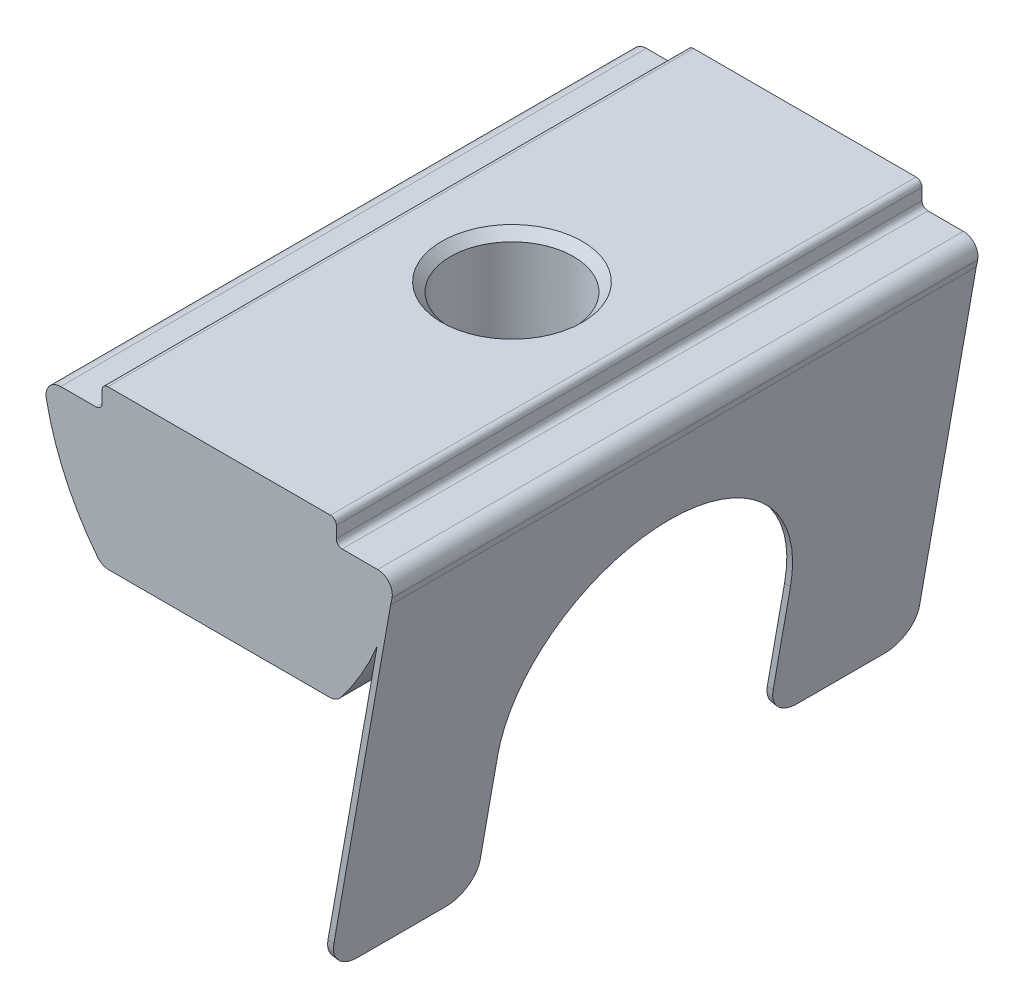
ISO-10303-21;
HEADER;
FILE_DESCRIPTION(('STEP AP214'),'2;1');
FILE_NAME('part.step','',(''),(''),'','','');
FILE_SCHEMA(('AUTOMOTIVE_DESIGN { 1 0 10303 214 1 1 1 1 }'));
ENDSEC;
DATA;
#1=APPLICATION_CONTEXT('core data for automotive mechanical design processes');
#2=APPLICATION_PROTOCOL_DEFINITION('international standard','automotive_design',2000,#1);
#3=PRODUCT_CONTEXT('',#1,'mechanical');
#4=PRODUCT('Part','Part','',(#3));
#5=PRODUCT_RELATED_PRODUCT_CATEGORY('part','',(#4));
#6=PRODUCT_DEFINITION_FORMATION('','',#4);
#7=PRODUCT_DEFINITION_CONTEXT('part definition',#1,'design');
#8=PRODUCT_DEFINITION('design','',#6,#7);
#9=PRODUCT_DEFINITION_SHAPE('','',#8);
#10=(LENGTH_UNIT() NAMED_UNIT(*) SI_UNIT(.MILLI.,.METRE.));
#11=(NAMED_UNIT(*) PLANE_ANGLE_UNIT() SI_UNIT($,.RADIAN.));
#12=(NAMED_UNIT(*) SI_UNIT($,.STERADIAN.) SOLID_ANGLE_UNIT());
#13=UNCERTAINTY_MEASURE_WITH_UNIT(LENGTH_MEASURE(1.E-05),#10,'distance_accuracy_value','');
#14=(GEOMETRIC_REPRESENTATION_CONTEXT(3) GLOBAL_UNCERTAINTY_ASSIGNED_CONTEXT((#13)) GLOBAL_UNIT_ASSIGNED_CONTEXT((#10,
#11,#12)) REPRESENTATION_CONTEXT('',''));
#15=CARTESIAN_POINT('',(0.,0.,0.));
#16=DIRECTION('',(0.,0.,1.));
#17=DIRECTION('',(1.,0.,0.));
#18=AXIS2_PLACEMENT_3D('',#15,#16,#17);
#19=CARTESIAN_POINT('',(3.74257369033,-10.9025007891587,-23.0356452170601));
#20=DIRECTION('',(-0.173648177666917,-0.984807753012211,0.));
#21=DIRECTION('',(0.984807753012211,-0.173648177666917,0.));
#22=AXIS2_PLACEMENT_3D('',#19,#20,#21);
#23=PLANE('',#22);
#24=DIRECTION('',(0.,0.,1.));
#25=VECTOR('',#24,1.);
#26=CARTESIAN_POINT('',(3.74257369033,-10.9025007891587,-23.0356452170601));
#27=LINE('',#26,#25);
#28=CARTESIAN_POINT('',(3.74257369033,-10.9025007891587,6.));
#29=VERTEX_POINT('',#28);
#30=CARTESIAN_POINT('',(3.74257369033,-10.9025007891587,9.));
#31=VERTEX_POINT('',#30);
#32=EDGE_CURVE('E248',#29,#31,#27,.T.);
#33=ORIENTED_EDGE('',*,*,#32,.T.);
#34=DIRECTION('',(0.984807753012211,-0.173648177666917,0.));
#35=VECTOR('',#34,1.);
#36=CARTESIAN_POINT('',(3.54561213972756,-10.8677711536253,9.));
#37=LINE('',#36,#35);
#38=CARTESIAN_POINT('',(3.54561213972756,-10.8677711536253,9.));
#39=VERTEX_POINT('',#38);
#40=EDGE_CURVE('E397',#31,#39,#37,.F.);
#41=ORIENTED_EDGE('',*,*,#40,.T.);
#42=DIRECTION('',(0.,0.,1.));
#43=VECTOR('',#42,1.);
#44=CARTESIAN_POINT('',(3.54561213972756,-10.8677711536253,-23.0356452170601));
#45=LINE('',#44,#43);
#46=CARTESIAN_POINT('',(3.54561213972756,-10.8677711536253,6.));
#47=VERTEX_POINT('',#46);
#48=EDGE_CURVE('E243',#47,#39,#45,.T.);
#49=ORIENTED_EDGE('',*,*,#48,.F.);
#50=DIRECTION('',(-0.984807753012211,0.173648177666917,0.));
#51=VECTOR('',#50,1.);
#52=CARTESIAN_POINT('',(3.74257369033,-10.9025007891587,6.));
#53=LINE('',#52,#51);
#54=EDGE_CURVE('E395',#47,#29,#53,.F.);
#55=ORIENTED_EDGE('',*,*,#54,.T.);
#56=EDGE_LOOP('',(#33,#41,#49,#55));
#57=FACE_BOUND('',#56,.T.);
#58=ADVANCED_FACE('F16',(#57),#23,.T.);
#59=CARTESIAN_POINT('',(-2.92669013738907,3.04638701625612,10.));
#60=DIRECTION('',(0.,0.,-1.));
#61=DIRECTION('',(-1.,0.,0.));
#62=AXIS2_PLACEMENT_3D('',#59,#60,#61);
#63=CYLINDRICAL_SURFACE('',#62,9.);
#64=CARTESIAN_POINT('',(-2.92669013738907,3.04638701625612,-10.));
#65=DIRECTION('',(0.,0.,1.));
#66=DIRECTION('',(-1.,0.,0.));
#67=AXIS2_PLACEMENT_3D('',#64,#65,#66);
#68=CIRCLE('',#67,9.);
#69=CARTESIAN_POINT('',(5.85374216436443,1.0705305957833,-10.));
#70=VERTEX_POINT('',#69);
#71=CARTESIAN_POINT('',(5.90287030593252,1.30315370492611,-10.));
#72=VERTEX_POINT('',#71);
#73=EDGE_CURVE('E295',#70,#72,#68,.T.);
#74=ORIENTED_EDGE('',*,*,#73,.T.);
#75=DIRECTION('',(0.,0.,-1.));
#76=VECTOR('',#75,1.);
#77=CARTESIAN_POINT('',(5.90287030593252,1.30315370492611,10.));
#78=LINE('',#77,#76);
#79=CARTESIAN_POINT('',(5.90287030593252,1.30315370492611,10.));
#80=VERTEX_POINT('',#79);
#81=EDGE_CURVE('E382',#72,#80,#78,.F.);
#82=ORIENTED_EDGE('',*,*,#81,.T.);
#83=CARTESIAN_POINT('',(-2.92669013738907,3.04638701625612,10.));
#84=DIRECTION('',(0.,0.,1.));
#85=DIRECTION('',(-1.,0.,0.));
#86=AXIS2_PLACEMENT_3D('',#83,#84,#85);
#87=CIRCLE('',#86,9.);
#88=CARTESIAN_POINT('',(5.85374216436443,1.0705305957833,10.));
#89=VERTEX_POINT('',#88);
#90=EDGE_CURVE('E272',#89,#80,#87,.T.);
#91=ORIENTED_EDGE('',*,*,#90,.F.);
#92=DIRECTION('',(0.,0.,-1.));
#93=VECTOR('',#92,1.);
#94=CARTESIAN_POINT('',(5.85374216436442,1.07053059578327,10.));
#95=LINE('',#94,#93);
#96=EDGE_CURVE('E255',#89,#70,#95,.T.);
#97=ORIENTED_EDGE('',*,*,#96,.T.);
#98=EDGE_LOOP('',(#74,#82,#91,#97));
#99=FACE_BOUND('',#98,.T.);
#100=ADVANCED_FACE('F433',(#99),#63,.T.);
#101=CARTESIAN_POINT('',(-4.,1.9,10.));
#102=DIRECTION('',(1.,0.,0.));
#103=DIRECTION('',(0.,0.,-1.));
#104=AXIS2_PLACEMENT_3D('',#101,#102,#103);
#105=PLANE('',#104);
#106=DIRECTION('',(0.,-1.,0.));
#107=VECTOR('',#106,1.);
#108=CARTESIAN_POINT('',(-4.,1.9,10.));
#109=LINE('',#108,#107);
#110=CARTESIAN_POINT('',(-4.,2.5,10.));
#111=VERTEX_POINT('',#110);
#112=CARTESIAN_POINT('',(-4.,2.1,10.));
#113=VERTEX_POINT('',#112);
#114=EDGE_CURVE('E259',#111,#113,#109,.T.);
#115=ORIENTED_EDGE('',*,*,#114,.F.);
#116=DIRECTION('',(0.,0.,-1.));
#117=VECTOR('',#116,1.);
#118=CARTESIAN_POINT('',(-4.,2.5,10.));
#119=LINE('',#118,#117);
#120=CARTESIAN_POINT('',(-4.,2.5,-10.));
#121=VERTEX_POINT('',#120);
#122=EDGE_CURVE('E306',#111,#121,#119,.T.);
#123=ORIENTED_EDGE('',*,*,#122,.T.);
#124=DIRECTION('',(0.,-1.,0.));
#125=VECTOR('',#124,1.);
#126=CARTESIAN_POINT('',(-4.,1.9,-10.));
#127=LINE('',#126,#125);
#128=CARTESIAN_POINT('',(-4.,2.1,-10.));
#129=VERTEX_POINT('',#128);
#130=EDGE_CURVE('E258',#121,#129,#127,.T.);
#131=ORIENTED_EDGE('',*,*,#130,.T.);
#132=DIRECTION('',(0.,0.,-1.));
#133=VECTOR('',#132,1.);
#134=CARTESIAN_POINT('',(-4.,2.1,10.));
#135=LINE('',#134,#133);
#136=EDGE_CURVE('E283',#129,#113,#135,.F.);
#137=ORIENTED_EDGE('',*,*,#136,.T.);
#138=EDGE_LOOP('',(#115,#123,#131,#137));
#139=FACE_BOUND('',#138,.T.);
#140=ADVANCED_FACE('F440',(#139),#105,.F.);
#141=CARTESIAN_POINT('',(-6.,1.9,10.));
#142=DIRECTION('',(0.,-1.,0.));
#143=DIRECTION('',(1.,0.,0.));
#144=AXIS2_PLACEMENT_3D('',#141,#142,#143);
#145=PLANE('',#144);
#146=DIRECTION('',(-1.,0.,0.));
#147=VECTOR('',#146,1.);
#148=CARTESIAN_POINT('',(-6.,1.9,-10.));
#149=LINE('',#148,#147);
#150=CARTESIAN_POINT('',(-4.2,1.9,-10.));
#151=VERTEX_POINT('',#150);
#152=CARTESIAN_POINT('',(-5.41233917019243,1.9,-10.));
#153=VERTEX_POINT('',#152);
#154=EDGE_CURVE('E286',#151,#153,#149,.T.);
#155=ORIENTED_EDGE('',*,*,#154,.T.);
#156=DIRECTION('',(0.,0.,-1.));
#157=VECTOR('',#156,1.);
#158=CARTESIAN_POINT('',(-5.41233917019243,1.9,10.));
#159=LINE('',#158,#157);
#160=CARTESIAN_POINT('',(-5.41233917019243,1.9,10.));
#161=VERTEX_POINT('',#160);
#162=EDGE_CURVE('E377',#153,#161,#159,.F.);
#163=ORIENTED_EDGE('',*,*,#162,.T.);
#164=DIRECTION('',(-1.,0.,0.));
#165=VECTOR('',#164,1.);
#166=CARTESIAN_POINT('',(-6.,1.9,10.));
#167=LINE('',#166,#165);
#168=CARTESIAN_POINT('',(-4.2,1.9,10.));
#169=VERTEX_POINT('',#168);
#170=EDGE_CURVE('E262',#169,#161,#167,.T.);
#171=ORIENTED_EDGE('',*,*,#170,.F.);
#172=DIRECTION('',(0.,0.,-1.));
#173=VECTOR('',#172,1.);
#174=CARTESIAN_POINT('',(-4.2,1.9,-10.));
#175=LINE('',#174,#173);
#176=EDGE_CURVE('E327',#169,#151,#175,.T.);
#177=ORIENTED_EDGE('',*,*,#176,.T.);
#178=EDGE_LOOP('',(#155,#163,#171,#177));
#179=FACE_BOUND('',#178,.T.);
#180=ADVANCED_FACE('F514',(#179),#145,.F.);
#181=CARTESIAN_POINT('',(2.92669013738908,3.04638701625612,10.));
#182=DIRECTION('',(0.,0.,-1.));
#183=DIRECTION('',(-1.,0.,0.));
#184=AXIS2_PLACEMENT_3D('',#181,#182,#183);
#185=CYLINDRICAL_SURFACE('',#184,9.);
#186=CARTESIAN_POINT('',(2.92669013738908,3.04638701625612,-10.));
#187=DIRECTION('',(0.,0.,1.));
#188=DIRECTION('',(1.,0.,0.));
#189=AXIS2_PLACEMENT_3D('',#186,#187,#188);
#190=CIRCLE('',#189,9.);
#191=CARTESIAN_POINT('',(-5.90287030593252,1.30315370492611,-10.));
#192=VERTEX_POINT('',#191);
#193=CARTESIAN_POINT('',(-4.15441126202378,-2.50861100095624,-10.));
#194=VERTEX_POINT('',#193);
#195=EDGE_CURVE('E289',#192,#194,#190,.T.);
#196=ORIENTED_EDGE('',*,*,#195,.T.);
#197=DIRECTION('',(0.,0.,-1.));
#198=VECTOR('',#197,1.);
#199=CARTESIAN_POINT('',(-4.15441126202378,-2.50861100095624,10.));
#200=LINE('',#199,#198);
#201=CARTESIAN_POINT('',(-4.15441126202378,-2.50861100095624,10.));
#202=VERTEX_POINT('',#201);
#203=EDGE_CURVE('E375',#194,#202,#200,.F.);
#204=ORIENTED_EDGE('',*,*,#203,.T.);
#205=CARTESIAN_POINT('',(2.92669013738908,3.04638701625612,10.));
#206=DIRECTION('',(0.,0.,1.));
#207=DIRECTION('',(1.,0.,0.));
#208=AXIS2_PLACEMENT_3D('',#205,#206,#207);
#209=CIRCLE('',#208,9.);
#210=CARTESIAN_POINT('',(-5.90287030593252,1.30315370492611,10.));
#211=VERTEX_POINT('',#210);
#212=EDGE_CURVE('E266',#211,#202,#209,.T.);
#213=ORIENTED_EDGE('',*,*,#212,.F.);
#214=DIRECTION('',(0.,0.,-1.));
#215=VECTOR('',#214,1.);
#216=CARTESIAN_POINT('',(-5.90287030593252,1.30315370492611,10.));
#217=LINE('',#216,#215);
#218=EDGE_CURVE('E372',#211,#192,#217,.T.);
#219=ORIENTED_EDGE('',*,*,#218,.T.);
#220=EDGE_LOOP('',(#196,#204,#213,#219));
#221=FACE_BOUND('',#220,.T.);
#222=ADVANCED_FACE('F523',(#221),#185,.T.);
#223=CARTESIAN_POINT('',(4.,-2.7,10.));
#224=DIRECTION('',(0.,1.,0.));
#225=DIRECTION('',(0.,0.,1.));
#226=AXIS2_PLACEMENT_3D('',#223,#224,#225);
#227=PLANE('',#226);
#228=CARTESIAN_POINT('',(0.,-2.7,0.));
#229=DIRECTION('',(0.,1.,0.));
#230=DIRECTION('',(0.,0.,1.));
#231=AXIS2_PLACEMENT_3D('',#228,#229,#230);
#232=CIRCLE('',#231,2.4);
#233=CARTESIAN_POINT('',(0.,-2.7,2.4));
#234=VERTEX_POINT('',#233);
#235=EDGE_CURVE('E24',#234,#234,#232,.T.);
#236=ORIENTED_EDGE('',*,*,#235,.T.);
#237=EDGE_LOOP('',(#236));
#238=FACE_BOUND('',#237,.T.);
#239=DIRECTION('',(1.,0.,0.));
#240=VECTOR('',#239,1.);
#241=CARTESIAN_POINT('',(4.,-2.7,-10.));
#242=LINE('',#241,#240);
#243=CARTESIAN_POINT('',(-3.76101673983418,-2.7,-10.));
#244=VERTEX_POINT('',#243);
#245=CARTESIAN_POINT('',(3.76101673983418,-2.7,-10.));
#246=VERTEX_POINT('',#245);
#247=EDGE_CURVE('E292',#244,#246,#242,.T.);
#248=ORIENTED_EDGE('',*,*,#247,.T.);
#249=DIRECTION('',(0.,0.,-1.));
#250=VECTOR('',#249,1.);
#251=CARTESIAN_POINT('',(3.76101673983418,-2.7,10.));
#252=LINE('',#251,#250);
#253=CARTESIAN_POINT('',(3.76101673983418,-2.7,10.));
#254=VERTEX_POINT('',#253);
#255=EDGE_CURVE('E362',#246,#254,#252,.F.);
#256=ORIENTED_EDGE('',*,*,#255,.T.);
#257=DIRECTION('',(1.,0.,0.));
#258=VECTOR('',#257,1.);
#259=CARTESIAN_POINT('',(4.,-2.7,10.));
#260=LINE('',#259,#258);
#261=CARTESIAN_POINT('',(-3.76101673983418,-2.7,10.));
#262=VERTEX_POINT('',#261);
#263=EDGE_CURVE('E269',#262,#254,#260,.T.);
#264=ORIENTED_EDGE('',*,*,#263,.F.);
#265=DIRECTION('',(0.,0.,-1.));
#266=VECTOR('',#265,1.);
#267=CARTESIAN_POINT('',(-3.76101673983418,-2.7,10.));
#268=LINE('',#267,#266);
#269=EDGE_CURVE('E359',#262,#244,#268,.T.);
#270=ORIENTED_EDGE('',*,*,#269,.T.);
#271=EDGE_LOOP('',(#248,#256,#264,#270));
#272=FACE_BOUND('',#271,.T.);
#273=ADVANCED_FACE('F419',(#238,#272),#227,.F.);
#274=CARTESIAN_POINT('',(4.15441126202378,-2.50861100095624,10.));
#275=VERTEX_POINT('',#274);
#276=CARTESIAN_POINT('',(5.39438595917238,-0.382853802822279,10.));
#277=VERTEX_POINT('',#276);
#278=EDGE_CURVE('E273',#275,#277,#87,.T.);
#279=ORIENTED_EDGE('',*,*,#278,.F.);
#280=DIRECTION('',(0.,0.,-1.));
#281=VECTOR('',#280,1.);
#282=CARTESIAN_POINT('',(4.15441126202378,-2.50861100095624,10.));
#283=LINE('',#282,#281);
#284=CARTESIAN_POINT('',(4.15441126202378,-2.50861100095624,-10.));
#285=VERTEX_POINT('',#284);
#286=EDGE_CURVE('E348',#275,#285,#283,.T.);
#287=ORIENTED_EDGE('',*,*,#286,.T.);
#288=CARTESIAN_POINT('',(5.39438595917254,-0.382853802822292,-10.));
#289=VERTEX_POINT('',#288);
#290=EDGE_CURVE('E296',#285,#289,#68,.T.);
#291=ORIENTED_EDGE('',*,*,#290,.T.);
#292=DIRECTION('',(0.,0.,1.));
#293=VECTOR('',#292,1.);
#294=CARTESIAN_POINT('',(5.39438595917238,-0.382853802822291,-23.0356452170601));
#295=LINE('',#294,#293);
#296=EDGE_CURVE('E246',#289,#277,#295,.T.);
#297=ORIENTED_EDGE('',*,*,#296,.T.);
#298=EDGE_LOOP('',(#279,#287,#291,#297));
#299=FACE_BOUND('',#298,.T.);
#300=ADVANCED_FACE('F443',(#299),#63,.T.);
#301=CARTESIAN_POINT('',(4.,1.9,10.));
#302=DIRECTION('',(0.,-1.,0.));
#303=DIRECTION('',(1.,0.,0.));
#304=AXIS2_PLACEMENT_3D('',#301,#302,#303);
#305=PLANE('',#304);
#306=DIRECTION('',(-1.,0.,0.));
#307=VECTOR('',#306,1.);
#308=CARTESIAN_POINT('',(4.,1.9,10.));
#309=LINE('',#308,#307);
#310=CARTESIAN_POINT('',(5.41233917019243,1.9,10.));
#311=VERTEX_POINT('',#310);
#312=CARTESIAN_POINT('',(4.2,1.9,10.));
#313=VERTEX_POINT('',#312);
#314=EDGE_CURVE('E275',#311,#313,#309,.T.);
#315=ORIENTED_EDGE('',*,*,#314,.F.);
#316=DIRECTION('',(0.,0.,-1.));
#317=VECTOR('',#316,1.);
#318=CARTESIAN_POINT('',(5.41233917019243,1.9,10.));
#319=LINE('',#318,#317);
#320=CARTESIAN_POINT('',(5.41233917019243,1.9,-10.));
#321=VERTEX_POINT('',#320);
#322=EDGE_CURVE('E379',#311,#321,#319,.T.);
#323=ORIENTED_EDGE('',*,*,#322,.T.);
#324=DIRECTION('',(-1.,0.,0.));
#325=VECTOR('',#324,1.);
#326=CARTESIAN_POINT('',(4.,1.9,-10.));
#327=LINE('',#326,#325);
#328=CARTESIAN_POINT('',(4.2,1.9,-10.));
#329=VERTEX_POINT('',#328);
#330=EDGE_CURVE('E298',#321,#329,#327,.T.);
#331=ORIENTED_EDGE('',*,*,#330,.T.);
#332=DIRECTION('',(0.,0.,-1.));
#333=VECTOR('',#332,1.);
#334=CARTESIAN_POINT('',(4.2,1.9,10.));
#335=LINE('',#334,#333);
#336=EDGE_CURVE('E330',#329,#313,#335,.F.);
#337=ORIENTED_EDGE('',*,*,#336,.T.);
#338=EDGE_LOOP('',(#315,#323,#331,#337));
#339=FACE_BOUND('',#338,.T.);
#340=ADVANCED_FACE('F482',(#339),#305,.F.);
#341=CARTESIAN_POINT('',(4.,2.7,10.));
#342=DIRECTION('',(-1.,0.,0.));
#343=DIRECTION('',(0.,0.,1.));
#344=AXIS2_PLACEMENT_3D('',#341,#342,#343);
#345=PLANE('',#344);
#346=DIRECTION('',(0.,1.,0.));
#347=VECTOR('',#346,1.);
#348=CARTESIAN_POINT('',(4.,2.7,-10.));
#349=LINE('',#348,#347);
#350=CARTESIAN_POINT('',(4.,2.1,-10.));
#351=VERTEX_POINT('',#350);
#352=CARTESIAN_POINT('',(4.,2.5,-10.));
#353=VERTEX_POINT('',#352);
#354=EDGE_CURVE('E300',#351,#353,#349,.T.);
#355=ORIENTED_EDGE('',*,*,#354,.T.);
#356=DIRECTION('',(0.,0.,-1.));
#357=VECTOR('',#356,1.);
#358=CARTESIAN_POINT('',(4.,2.5,10.));
#359=LINE('',#358,#357);
#360=CARTESIAN_POINT('',(4.,2.5,10.));
#361=VERTEX_POINT('',#360);
#362=EDGE_CURVE('E325',#353,#361,#359,.F.);
#363=ORIENTED_EDGE('',*,*,#362,.T.);
#364=DIRECTION('',(0.,1.,0.));
#365=VECTOR('',#364,1.);
#366=CARTESIAN_POINT('',(4.,2.7,10.));
#367=LINE('',#366,#365);
#368=CARTESIAN_POINT('',(4.,2.1,10.));
#369=VERTEX_POINT('',#368);
#370=EDGE_CURVE('E277',#369,#361,#367,.T.);
#371=ORIENTED_EDGE('',*,*,#370,.F.);
#372=DIRECTION('',(0.,0.,-1.));
#373=VECTOR('',#372,1.);
#374=CARTESIAN_POINT('',(4.,2.1,-10.));
#375=LINE('',#374,#373);
#376=EDGE_CURVE('E322',#369,#351,#375,.T.);
#377=ORIENTED_EDGE('',*,*,#376,.T.);
#378=EDGE_LOOP('',(#355,#363,#371,#377));
#379=FACE_BOUND('',#378,.T.);
#380=ADVANCED_FACE('F491',(#379),#345,.F.);
#381=CARTESIAN_POINT('',(-4.,2.7,10.));
#382=DIRECTION('',(0.,-1.,0.));
#383=DIRECTION('',(1.,0.,0.));
#384=AXIS2_PLACEMENT_3D('',#381,#382,#383);
#385=PLANE('',#384);
#386=CARTESIAN_POINT('',(0.,2.7,0.));
#387=DIRECTION('',(0.,-1.,0.));
#388=DIRECTION('',(1.,0.,0.));
#389=AXIS2_PLACEMENT_3D('',#386,#387,#388);
#390=CIRCLE('',#389,2.40000000000001);
#391=CARTESIAN_POINT('',(2.40000000000001,2.7,0.));
#392=VERTEX_POINT('',#391);
#393=EDGE_CURVE('E345',#392,#392,#390,.T.);
#394=ORIENTED_EDGE('',*,*,#393,.T.);
#395=EDGE_LOOP('',(#394));
#396=FACE_BOUND('',#395,.T.);
#397=DIRECTION('',(-1.,0.,0.));
#398=VECTOR('',#397,1.);
#399=CARTESIAN_POINT('',(-4.,2.7,-10.));
#400=LINE('',#399,#398);
#401=CARTESIAN_POINT('',(3.8,2.7,-10.));
#402=VERTEX_POINT('',#401);
#403=CARTESIAN_POINT('',(-3.8,2.7,-10.));
#404=VERTEX_POINT('',#403);
#405=EDGE_CURVE('E263',#402,#404,#400,.T.);
#406=ORIENTED_EDGE('',*,*,#405,.T.);
#407=DIRECTION('',(0.,0.,-1.));
#408=VECTOR('',#407,1.);
#409=CARTESIAN_POINT('',(-3.8,2.7,10.));
#410=LINE('',#409,#408);
#411=CARTESIAN_POINT('',(-3.8,2.7,10.));
#412=VERTEX_POINT('',#411);
#413=EDGE_CURVE('E316',#404,#412,#410,.F.);
#414=ORIENTED_EDGE('',*,*,#413,.T.);
#415=DIRECTION('',(-1.,0.,0.));
#416=VECTOR('',#415,1.);
#417=CARTESIAN_POINT('',(-4.,2.7,10.));
#418=LINE('',#417,#416);
#419=CARTESIAN_POINT('',(3.8,2.7,10.));
#420=VERTEX_POINT('',#419);
#421=EDGE_CURVE('E280',#420,#412,#418,.T.);
#422=ORIENTED_EDGE('',*,*,#421,.F.);
#423=DIRECTION('',(0.,0.,-1.));
#424=VECTOR('',#423,1.);
#425=CARTESIAN_POINT('',(3.8,2.7,10.));
#426=LINE('',#425,#424);
#427=EDGE_CURVE('E313',#420,#402,#426,.T.);
#428=ORIENTED_EDGE('',*,*,#427,.T.);
#429=EDGE_LOOP('',(#406,#414,#422,#428));
#430=FACE_BOUND('',#429,.T.);
#431=ADVANCED_FACE('F499',(#396,#430),#385,.F.);
#432=CARTESIAN_POINT('',(-2.92669013738907,3.04638701625612,10.));
#433=DIRECTION('',(0.,0.,-1.));
#434=DIRECTION('',(-1.,0.,0.));
#435=AXIS2_PLACEMENT_3D('',#432,#433,#434);
#436=PLANE('',#435);
#437=DIRECTION('',(-0.173648177666939,-0.984807753012207,0.));
#438=VECTOR('',#437,1.);
#439=CARTESIAN_POINT('',(3.54689679300016,-10.8604855228759,10.));
#440=LINE('',#439,#438);
#441=CARTESIAN_POINT('',(3.71926031739449,-9.88296340061313,10.));
#442=VERTEX_POINT('',#441);
#443=EDGE_CURVE('E234',#277,#442,#440,.T.);
#444=ORIENTED_EDGE('',*,*,#443,.T.);
#445=DIRECTION('',(0.984807753012211,-0.173648177666917,0.));
#446=VECTOR('',#445,1.);
#447=CARTESIAN_POINT('',(3.91622186799692,-9.91769303614651,10.));
#448=LINE('',#447,#446);
#449=CARTESIAN_POINT('',(3.91622186799692,-9.91769303614651,10.));
#450=VERTEX_POINT('',#449);
#451=EDGE_CURVE('E384',#442,#450,#448,.T.);
#452=ORIENTED_EDGE('',*,*,#451,.T.);
#453=DIRECTION('',(0.173648177666923,0.984807753012209,0.));
#454=VECTOR('',#453,1.);
#455=CARTESIAN_POINT('',(6.,1.9,10.));
#456=LINE('',#455,#454);
#457=EDGE_CURVE('E236',#450,#89,#456,.T.);
#458=ORIENTED_EDGE('',*,*,#457,.T.);
#459=ORIENTED_EDGE('',*,*,#90,.T.);
#460=CARTESIAN_POINT('',(5.41233917019243,1.4,10.));
#461=DIRECTION('',(0.,0.,-1.));
#462=DIRECTION('',(-1.,0.,0.));
#463=AXIS2_PLACEMENT_3D('',#460,#461,#462);
#464=CIRCLE('',#463,0.5);
#465=EDGE_CURVE('E364',#80,#311,#464,.F.);
#466=ORIENTED_EDGE('',*,*,#465,.T.);
#467=ORIENTED_EDGE('',*,*,#314,.T.);
#468=CARTESIAN_POINT('',(4.2,2.1,10.));
#469=DIRECTION('',(0.,0.,-1.));
#470=DIRECTION('',(-1.,0.,0.));
#471=AXIS2_PLACEMENT_3D('',#468,#469,#470);
#472=CIRCLE('',#471,0.2);
#473=EDGE_CURVE('E340',#313,#369,#472,.T.);
#474=ORIENTED_EDGE('',*,*,#473,.T.);
#475=ORIENTED_EDGE('',*,*,#370,.T.);
#476=CARTESIAN_POINT('',(3.8,2.5,10.));
#477=DIRECTION('',(0.,0.,-1.));
#478=DIRECTION('',(-1.,0.,0.));
#479=AXIS2_PLACEMENT_3D('',#476,#477,#478);
#480=CIRCLE('',#479,0.2);
#481=EDGE_CURVE('E318',#361,#420,#480,.F.);
#482=ORIENTED_EDGE('',*,*,#481,.T.);
#483=ORIENTED_EDGE('',*,*,#421,.T.);
#484=CARTESIAN_POINT('',(-3.8,2.5,10.));
#485=DIRECTION('',(0.,0.,-1.));
#486=DIRECTION('',(-1.,0.,0.));
#487=AXIS2_PLACEMENT_3D('',#484,#485,#486);
#488=CIRCLE('',#487,0.2);
#489=EDGE_CURVE('E320',#412,#111,#488,.F.);
#490=ORIENTED_EDGE('',*,*,#489,.T.);
#491=ORIENTED_EDGE('',*,*,#114,.T.);
#492=CARTESIAN_POINT('',(-4.2,2.1,10.));
#493=DIRECTION('',(0.,0.,-1.));
#494=DIRECTION('',(-1.,0.,0.));
#495=AXIS2_PLACEMENT_3D('',#492,#493,#494);
#496=CIRCLE('',#495,0.2);
#497=EDGE_CURVE('E335',#113,#169,#496,.T.);
#498=ORIENTED_EDGE('',*,*,#497,.T.);
#499=ORIENTED_EDGE('',*,*,#170,.T.);
#500=CARTESIAN_POINT('',(-5.41233917019243,1.4,10.));
#501=DIRECTION('',(0.,0.,-1.));
#502=DIRECTION('',(-1.,0.,0.));
#503=AXIS2_PLACEMENT_3D('',#500,#501,#502);
#504=CIRCLE('',#503,0.5);
#505=EDGE_CURVE('E366',#161,#211,#504,.F.);
#506=ORIENTED_EDGE('',*,*,#505,.T.);
#507=ORIENTED_EDGE('',*,*,#212,.T.);
#508=CARTESIAN_POINT('',(-3.76101673983418,-2.2,10.));
#509=DIRECTION('',(0.,0.,-1.));
#510=DIRECTION('',(-1.,0.,0.));
#511=AXIS2_PLACEMENT_3D('',#508,#509,#510);
#512=CIRCLE('',#511,0.5);
#513=EDGE_CURVE('E368',#202,#262,#512,.F.);
#514=ORIENTED_EDGE('',*,*,#513,.T.);
#515=ORIENTED_EDGE('',*,*,#263,.T.);
#516=CARTESIAN_POINT('',(3.76101673983418,-2.2,10.));
#517=DIRECTION('',(0.,0.,-1.));
#518=DIRECTION('',(-1.,0.,0.));
#519=AXIS2_PLACEMENT_3D('',#516,#517,#518);
#520=CIRCLE('',#519,0.5);
#521=EDGE_CURVE('E370',#254,#275,#520,.F.);
#522=ORIENTED_EDGE('',*,*,#521,.T.);
#523=ORIENTED_EDGE('',*,*,#278,.T.);
#524=EDGE_LOOP('',(#444,#452,#458,#459,#466,#467,#474,#475,#482,#483,#490,#491,#498,#499,#506,
#507,#514,#515,#522,#523));
#525=FACE_BOUND('',#524,.T.);
#526=ADVANCED_FACE('F480',(#525),#436,.F.);
#527=CARTESIAN_POINT('',(-2.92669013738907,3.04638701625612,-10.));
#528=DIRECTION('',(0.,0.,-1.));
#529=DIRECTION('',(-1.,0.,0.));
#530=AXIS2_PLACEMENT_3D('',#527,#528,#529);
#531=PLANE('',#530);
#532=DIRECTION('',(0.173648177666923,0.984807753012209,0.));
#533=VECTOR('',#532,1.);
#534=CARTESIAN_POINT('',(6.,1.9,-10.));
#535=LINE('',#534,#533);
#536=CARTESIAN_POINT('',(3.91622186799692,-9.91769303614651,-10.));
#537=VERTEX_POINT('',#536);
#538=EDGE_CURVE('E244',#537,#70,#535,.T.);
#539=ORIENTED_EDGE('',*,*,#538,.F.);
#540=DIRECTION('',(0.984807753012211,-0.173648177666917,0.));
#541=VECTOR('',#540,1.);
#542=CARTESIAN_POINT('',(-4.9373393515743,-8.35657131778209,-10.));
#543=LINE('',#542,#541);
#544=CARTESIAN_POINT('',(3.71926031739449,-9.88296340061313,-10.));
#545=VERTEX_POINT('',#544);
#546=EDGE_CURVE('E413',#537,#545,#543,.F.);
#547=ORIENTED_EDGE('',*,*,#546,.T.);
#548=DIRECTION('',(-0.173648177666939,-0.984807753012207,0.));
#549=VECTOR('',#548,1.);
#550=CARTESIAN_POINT('',(3.54689679300016,-10.8604855228759,-10.));
#551=LINE('',#550,#549);
#552=EDGE_CURVE('E238',#289,#545,#551,.T.);
#553=ORIENTED_EDGE('',*,*,#552,.F.);
#554=ORIENTED_EDGE('',*,*,#290,.F.);
#555=CARTESIAN_POINT('',(3.76101673983418,-2.2,-10.));
#556=DIRECTION('',(0.,0.,-1.));
#557=DIRECTION('',(-1.,0.,0.));
#558=AXIS2_PLACEMENT_3D('',#555,#556,#557);
#559=CIRCLE('',#558,0.5);
#560=EDGE_CURVE('E357',#285,#246,#559,.T.);
#561=ORIENTED_EDGE('',*,*,#560,.T.);
#562=ORIENTED_EDGE('',*,*,#247,.F.);
#563=CARTESIAN_POINT('',(-3.76101673983418,-2.2,-10.));
#564=DIRECTION('',(0.,0.,-1.));
#565=DIRECTION('',(-1.,0.,0.));
#566=AXIS2_PLACEMENT_3D('',#563,#564,#565);
#567=CIRCLE('',#566,0.5);
#568=EDGE_CURVE('E355',#244,#194,#567,.T.);
#569=ORIENTED_EDGE('',*,*,#568,.T.);
#570=ORIENTED_EDGE('',*,*,#195,.F.);
#571=CARTESIAN_POINT('',(-5.41233917019243,1.4,-10.));
#572=DIRECTION('',(0.,0.,-1.));
#573=DIRECTION('',(-1.,0.,0.));
#574=AXIS2_PLACEMENT_3D('',#571,#572,#573);
#575=CIRCLE('',#574,0.5);
#576=EDGE_CURVE('E353',#192,#153,#575,.T.);
#577=ORIENTED_EDGE('',*,*,#576,.T.);
#578=ORIENTED_EDGE('',*,*,#154,.F.);
#579=CARTESIAN_POINT('',(-4.2,2.1,-10.));
#580=DIRECTION('',(0.,0.,-1.));
#581=DIRECTION('',(-1.,0.,0.));
#582=AXIS2_PLACEMENT_3D('',#579,#580,#581);
#583=CIRCLE('',#582,0.2);
#584=EDGE_CURVE('E333',#151,#129,#583,.F.);
#585=ORIENTED_EDGE('',*,*,#584,.T.);
#586=ORIENTED_EDGE('',*,*,#130,.F.);
#587=CARTESIAN_POINT('',(-3.8,2.5,-10.));
#588=DIRECTION('',(0.,0.,-1.));
#589=DIRECTION('',(-1.,0.,0.));
#590=AXIS2_PLACEMENT_3D('',#587,#588,#589);
#591=CIRCLE('',#590,0.2);
#592=EDGE_CURVE('E311',#121,#404,#591,.T.);
#593=ORIENTED_EDGE('',*,*,#592,.T.);
#594=ORIENTED_EDGE('',*,*,#405,.F.);
#595=CARTESIAN_POINT('',(3.8,2.5,-10.));
#596=DIRECTION('',(0.,0.,-1.));
#597=DIRECTION('',(-1.,0.,0.));
#598=AXIS2_PLACEMENT_3D('',#595,#596,#597);
#599=CIRCLE('',#598,0.2);
#600=EDGE_CURVE('E309',#402,#353,#599,.T.);
#601=ORIENTED_EDGE('',*,*,#600,.T.);
#602=ORIENTED_EDGE('',*,*,#354,.F.);
#603=CARTESIAN_POINT('',(4.2,2.1,-10.));
#604=DIRECTION('',(0.,0.,-1.));
#605=DIRECTION('',(-1.,0.,0.));
#606=AXIS2_PLACEMENT_3D('',#603,#604,#605);
#607=CIRCLE('',#606,0.2);
#608=EDGE_CURVE('E337',#351,#329,#607,.F.);
#609=ORIENTED_EDGE('',*,*,#608,.T.);
#610=ORIENTED_EDGE('',*,*,#330,.F.);
#611=CARTESIAN_POINT('',(5.41233917019243,1.4,-10.));
#612=DIRECTION('',(0.,0.,-1.));
#613=DIRECTION('',(-1.,0.,0.));
#614=AXIS2_PLACEMENT_3D('',#611,#612,#613);
#615=CIRCLE('',#614,0.5);
#616=EDGE_CURVE('E351',#321,#72,#615,.T.);
#617=ORIENTED_EDGE('',*,*,#616,.T.);
#618=ORIENTED_EDGE('',*,*,#73,.F.);
#619=EDGE_LOOP('',(#539,#547,#553,#554,#561,#562,#569,#570,#577,#578,#585,#586,#593,#594,#601,
#602,#609,#610,#617,#618));
#620=FACE_BOUND('',#619,.T.);
#621=ADVANCED_FACE('F467',(#620),#531,.T.);
#622=CARTESIAN_POINT('',(0.,-2.7,0.));
#623=DIRECTION('',(0.,1.,0.));
#624=DIRECTION('',(-1.,0.,0.));
#625=AXIS2_PLACEMENT_3D('',#622,#623,#624);
#626=CYLINDRICAL_SURFACE('',#625,2.1);
#627=CARTESIAN_POINT('',(0.,-2.4,0.));
#628=DIRECTION('',(0.,1.,0.));
#629=DIRECTION('',(-1.,0.,0.));
#630=AXIS2_PLACEMENT_3D('',#627,#628,#629);
#631=CIRCLE('',#630,2.1);
#632=CARTESIAN_POINT('',(-2.1,-2.4,0.));
#633=VERTEX_POINT('',#632);
#634=EDGE_CURVE('E10',#633,#633,#631,.F.);
#635=ORIENTED_EDGE('',*,*,#634,.T.);
#636=EDGE_LOOP('',(#635));
#637=FACE_BOUND('',#636,.T.);
#638=CARTESIAN_POINT('',(0.,2.4,0.));
#639=DIRECTION('',(0.,-1.,0.));
#640=DIRECTION('',(1.,0.,0.));
#641=AXIS2_PLACEMENT_3D('',#638,#639,#640);
#642=CIRCLE('',#641,2.1);
#643=CARTESIAN_POINT('',(2.1,2.4,0.));
#644=VERTEX_POINT('',#643);
#645=EDGE_CURVE('E342',#644,#644,#642,.F.);
#646=ORIENTED_EDGE('',*,*,#645,.T.);
#647=EDGE_LOOP('',(#646));
#648=FACE_BOUND('',#647,.T.);
#649=ADVANCED_FACE('F567',(#637,#648),#626,.F.);
#650=CARTESIAN_POINT('',(6.,1.9,-23.0356452170601));
#651=DIRECTION('',(0.984807753012209,-0.173648177666923,0.));
#652=DIRECTION('',(0.173648177666923,0.984807753012209,0.));
#653=AXIS2_PLACEMENT_3D('',#650,#651,#652);
#654=PLANE('',#653);
#655=ORIENTED_EDGE('',*,*,#457,.F.);
#656=CARTESIAN_POINT('',(3.91622186799692,-9.91769303614651,9.));
#657=DIRECTION('',(0.984807753012209,-0.173648177666923,0.));
#658=DIRECTION('',(0.173648177666923,0.984807753012209,0.));
#659=AXIS2_PLACEMENT_3D('',#656,#657,#658);
#660=CIRCLE('',#659,1.);
#661=EDGE_CURVE('E393',#450,#31,#660,.T.);
#662=ORIENTED_EDGE('',*,*,#661,.T.);
#663=ORIENTED_EDGE('',*,*,#32,.F.);
#664=CARTESIAN_POINT('',(3.91622186799692,-9.91769303614651,6.));
#665=DIRECTION('',(0.984807753012209,-0.173648177666923,0.));
#666=DIRECTION('',(0.173648177666923,0.984807753012209,0.));
#667=AXIS2_PLACEMENT_3D('',#664,#665,#666);
#668=CIRCLE('',#667,1.);
#669=CARTESIAN_POINT('',(3.91622186799692,-9.91769303614651,5.));
#670=VERTEX_POINT('',#669);
#671=EDGE_CURVE('E391',#29,#670,#668,.T.);
#672=ORIENTED_EDGE('',*,*,#671,.T.);
#673=DIRECTION('',(-0.173648177666923,-0.984807753012209,0.));
#674=VECTOR('',#673,1.);
#675=CARTESIAN_POINT('',(3.6380294592403,-11.4954005862837,5.));
#676=LINE('',#675,#674);
#677=CARTESIAN_POINT('',(4.50627034757492,-6.57136182122261,5.));
#678=VERTEX_POINT('',#677);
#679=EDGE_CURVE('E211',#678,#670,#676,.T.);
#680=ORIENTED_EDGE('',*,*,#679,.F.);
#681=CARTESIAN_POINT('',(4.50627034757492,-6.57136182122261,0.));
#682=DIRECTION('',(0.984807753012209,-0.173648177666923,0.));
#683=DIRECTION('',(0.173648177666923,0.984807753012209,0.));
#684=AXIS2_PLACEMENT_3D('',#681,#682,#683);
#685=CIRCLE('',#684,5.);
#686=CARTESIAN_POINT('',(4.50627034757492,-6.57136182122261,-5.));
#687=VERTEX_POINT('',#686);
#688=EDGE_CURVE('E230',#687,#678,#685,.T.);
#689=ORIENTED_EDGE('',*,*,#688,.F.);
#690=DIRECTION('',(0.173648177666923,0.984807753012209,0.));
#691=VECTOR('',#690,1.);
#692=CARTESIAN_POINT('',(3.6380294592403,-11.4954005862837,-5.));
#693=LINE('',#692,#691);
#694=CARTESIAN_POINT('',(3.91622186799692,-9.91769303614651,-5.));
#695=VERTEX_POINT('',#694);
#696=EDGE_CURVE('E217',#695,#687,#693,.T.);
#697=ORIENTED_EDGE('',*,*,#696,.F.);
#698=CARTESIAN_POINT('',(3.91622186799692,-9.91769303614651,-6.));
#699=DIRECTION('',(0.984807753012209,-0.173648177666923,0.));
#700=DIRECTION('',(0.173648177666923,0.984807753012209,0.));
#701=AXIS2_PLACEMENT_3D('',#698,#699,#700);
#702=CIRCLE('',#701,1.);
#703=CARTESIAN_POINT('',(3.74257369033,-10.9025007891587,-6.));
#704=VERTEX_POINT('',#703);
#705=EDGE_CURVE('E387',#695,#704,#702,.T.);
#706=ORIENTED_EDGE('',*,*,#705,.T.);
#707=CARTESIAN_POINT('',(3.74257369033,-10.9025007891587,-9.));
#708=VERTEX_POINT('',#707);
#709=EDGE_CURVE('E247',#708,#704,#27,.T.);
#710=ORIENTED_EDGE('',*,*,#709,.F.);
#711=CARTESIAN_POINT('',(3.91622186799692,-9.91769303614651,-9.));
#712=DIRECTION('',(0.984807753012209,-0.173648177666923,0.));
#713=DIRECTION('',(0.173648177666923,0.984807753012209,0.));
#714=AXIS2_PLACEMENT_3D('',#711,#712,#713);
#715=CIRCLE('',#714,1.);
#716=EDGE_CURVE('E389',#708,#537,#715,.T.);
#717=ORIENTED_EDGE('',*,*,#716,.T.);
#718=ORIENTED_EDGE('',*,*,#538,.T.);
#719=ORIENTED_EDGE('',*,*,#96,.F.);
#720=EDGE_LOOP('',(#655,#662,#663,#672,#680,#689,#697,#706,#710,#717,#718,#719));
#721=FACE_BOUND('',#720,.T.);
#722=ADVANCED_FACE('F455',(#721),#654,.T.);
#723=CARTESIAN_POINT('',(3.54689679300016,-10.8604855228759,-23.0356452170601));
#724=DIRECTION('',(-0.984807753012207,0.173648177666939,0.));
#725=DIRECTION('',(-0.173648177666939,-0.984807753012207,0.));
#726=AXIS2_PLACEMENT_3D('',#723,#724,#725);
#727=PLANE('',#726);
#728=ORIENTED_EDGE('',*,*,#48,.T.);
#729=CARTESIAN_POINT('',(3.71926031739449,-9.88296340061313,9.));
#730=DIRECTION('',(-0.984807753012207,0.173648177666939,0.));
#731=DIRECTION('',(-0.173648177666939,-0.984807753012207,0.));
#732=AXIS2_PLACEMENT_3D('',#729,#730,#731);
#733=CIRCLE('',#732,1.);
#734=EDGE_CURVE('E404',#39,#442,#733,.T.);
#735=ORIENTED_EDGE('',*,*,#734,.T.);
#736=ORIENTED_EDGE('',*,*,#443,.F.);
#737=ORIENTED_EDGE('',*,*,#296,.F.);
#738=ORIENTED_EDGE('',*,*,#552,.T.);
#739=CARTESIAN_POINT('',(3.71926031739449,-9.88296340061313,-9.));
#740=DIRECTION('',(-0.984807753012207,0.173648177666939,0.));
#741=DIRECTION('',(-0.173648177666939,-0.984807753012207,0.));
#742=AXIS2_PLACEMENT_3D('',#739,#740,#741);
#743=CIRCLE('',#742,1.);
#744=CARTESIAN_POINT('',(3.54561213972756,-10.8677711536253,-9.));
#745=VERTEX_POINT('',#744);
#746=EDGE_CURVE('E400',#545,#745,#743,.T.);
#747=ORIENTED_EDGE('',*,*,#746,.T.);
#748=CARTESIAN_POINT('',(3.54561213972756,-10.8677711536253,-6.));
#749=VERTEX_POINT('',#748);
#750=EDGE_CURVE('E251',#745,#749,#45,.T.);
#751=ORIENTED_EDGE('',*,*,#750,.T.);
#752=CARTESIAN_POINT('',(3.71926031739449,-9.88296340061313,-6.));
#753=DIRECTION('',(-0.984807753012207,0.173648177666939,0.));
#754=DIRECTION('',(-0.173648177666939,-0.984807753012207,0.));
#755=AXIS2_PLACEMENT_3D('',#752,#753,#754);
#756=CIRCLE('',#755,1.);
#757=CARTESIAN_POINT('',(3.71926031739448,-9.88296340061313,-5.));
#758=VERTEX_POINT('',#757);
#759=EDGE_CURVE('E31',#749,#758,#756,.T.);
#760=ORIENTED_EDGE('',*,*,#759,.T.);
#761=DIRECTION('',(0.173648177666923,0.984807753012209,0.));
#762=VECTOR('',#761,1.);
#763=CARTESIAN_POINT('',(3.44106790863786,-11.4606709507503,-5.));
#764=LINE('',#763,#762);
#765=CARTESIAN_POINT('',(4.30930879697248,-6.53663218568922,-5.));
#766=VERTEX_POINT('',#765);
#767=EDGE_CURVE('E201',#758,#766,#764,.T.);
#768=ORIENTED_EDGE('',*,*,#767,.T.);
#769=CARTESIAN_POINT('',(4.30930879697248,-6.53663218568922,0.));
#770=DIRECTION('',(0.984807753012209,-0.173648177666923,0.));
#771=DIRECTION('',(0.173648177666923,0.984807753012209,0.));
#772=AXIS2_PLACEMENT_3D('',#769,#770,#771);
#773=CIRCLE('',#772,5.);
#774=CARTESIAN_POINT('',(4.30930879697248,-6.53663218568922,5.));
#775=VERTEX_POINT('',#774);
#776=EDGE_CURVE('E207',#766,#775,#773,.T.);
#777=ORIENTED_EDGE('',*,*,#776,.T.);
#778=DIRECTION('',(-0.173648177666923,-0.984807753012209,0.));
#779=VECTOR('',#778,1.);
#780=CARTESIAN_POINT('',(3.44106790863786,-11.4606709507503,5.));
#781=LINE('',#780,#779);
#782=CARTESIAN_POINT('',(3.71926031739448,-9.88296340061313,5.));
#783=VERTEX_POINT('',#782);
#784=EDGE_CURVE('E222',#775,#783,#781,.T.);
#785=ORIENTED_EDGE('',*,*,#784,.T.);
#786=CARTESIAN_POINT('',(3.71926031739449,-9.88296340061313,6.));
#787=DIRECTION('',(-0.984807753012207,0.173648177666939,0.));
#788=DIRECTION('',(-0.173648177666939,-0.984807753012207,0.));
#789=AXIS2_PLACEMENT_3D('',#786,#787,#788);
#790=CIRCLE('',#789,1.);
#791=EDGE_CURVE('E402',#783,#47,#790,.T.);
#792=ORIENTED_EDGE('',*,*,#791,.T.);
#793=EDGE_LOOP('',(#728,#735,#736,#737,#738,#747,#751,#760,#768,#777,#785,#792));
#794=FACE_BOUND('',#793,.T.);
#795=ADVANCED_FACE('F204',(#794),#727,.T.);
#796=ORIENTED_EDGE('',*,*,#750,.F.);
#797=DIRECTION('',(0.984807753012211,-0.173648177666917,0.));
#798=VECTOR('',#797,1.);
#799=CARTESIAN_POINT('',(3.74257369033,-10.9025007891587,-9.));
#800=LINE('',#799,#798);
#801=EDGE_CURVE('E410',#745,#708,#800,.T.);
#802=ORIENTED_EDGE('',*,*,#801,.T.);
#803=ORIENTED_EDGE('',*,*,#709,.T.);
#804=DIRECTION('',(0.984807753012211,-0.173648177666917,0.));
#805=VECTOR('',#804,1.);
#806=CARTESIAN_POINT('',(3.54561213972756,-10.8677711536253,-6.));
#807=LINE('',#806,#805);
#808=EDGE_CURVE('E39',#704,#749,#807,.F.);
#809=ORIENTED_EDGE('',*,*,#808,.T.);
#810=EDGE_LOOP('',(#796,#802,#803,#809));
#811=FACE_BOUND('',#810,.T.);
#812=ADVANCED_FACE('F436',(#811),#23,.T.);
#813=CARTESIAN_POINT('',(-3.8,2.5,10.));
#814=DIRECTION('',(0.,0.,-1.));
#815=DIRECTION('',(-1.,0.,0.));
#816=AXIS2_PLACEMENT_3D('',#813,#814,#815);
#817=CYLINDRICAL_SURFACE('',#816,0.2);
#818=ORIENTED_EDGE('',*,*,#489,.F.);
#819=ORIENTED_EDGE('',*,*,#413,.F.);
#820=ORIENTED_EDGE('',*,*,#592,.F.);
#821=ORIENTED_EDGE('',*,*,#122,.F.);
#822=EDGE_LOOP('',(#818,#819,#820,#821));
#823=FACE_BOUND('',#822,.T.);
#824=ADVANCED_FACE('F447',(#823),#817,.T.);
#825=CARTESIAN_POINT('',(3.8,2.5,10.));
#826=DIRECTION('',(0.,0.,-1.));
#827=DIRECTION('',(-1.,0.,0.));
#828=AXIS2_PLACEMENT_3D('',#825,#826,#827);
#829=CYLINDRICAL_SURFACE('',#828,0.2);
#830=ORIENTED_EDGE('',*,*,#481,.F.);
#831=ORIENTED_EDGE('',*,*,#362,.F.);
#832=ORIENTED_EDGE('',*,*,#600,.F.);
#833=ORIENTED_EDGE('',*,*,#427,.F.);
#834=EDGE_LOOP('',(#830,#831,#832,#833));
#835=FACE_BOUND('',#834,.T.);
#836=ADVANCED_FACE('F452',(#835),#829,.T.);
#837=CARTESIAN_POINT('',(-4.2,2.1,10.));
#838=DIRECTION('',(0.,0.,1.));
#839=DIRECTION('',(1.,0.,0.));
#840=AXIS2_PLACEMENT_3D('',#837,#838,#839);
#841=CYLINDRICAL_SURFACE('',#840,0.2);
#842=ORIENTED_EDGE('',*,*,#497,.F.);
#843=ORIENTED_EDGE('',*,*,#136,.F.);
#844=ORIENTED_EDGE('',*,*,#584,.F.);
#845=ORIENTED_EDGE('',*,*,#176,.F.);
#846=EDGE_LOOP('',(#842,#843,#844,#845));
#847=FACE_BOUND('',#846,.T.);
#848=ADVANCED_FACE('F509',(#847),#841,.F.);
#849=CARTESIAN_POINT('',(4.2,2.1,10.));
#850=DIRECTION('',(0.,0.,1.));
#851=DIRECTION('',(1.,0.,0.));
#852=AXIS2_PLACEMENT_3D('',#849,#850,#851);
#853=CYLINDRICAL_SURFACE('',#852,0.2);
#854=ORIENTED_EDGE('',*,*,#473,.F.);
#855=ORIENTED_EDGE('',*,*,#336,.F.);
#856=ORIENTED_EDGE('',*,*,#608,.F.);
#857=ORIENTED_EDGE('',*,*,#376,.F.);
#858=EDGE_LOOP('',(#854,#855,#856,#857));
#859=FACE_BOUND('',#858,.T.);
#860=ADVANCED_FACE('F487',(#859),#853,.F.);
#861=CARTESIAN_POINT('',(0.,2.4,0.));
#862=DIRECTION('',(0.,1.,0.));
#863=DIRECTION('',(-1.,0.,0.));
#864=AXIS2_PLACEMENT_3D('',#861,#862,#863);
#865=CONICAL_SURFACE('',#864,2.1,0.785398163397453);
#866=ORIENTED_EDGE('',*,*,#393,.F.);
#867=EDGE_LOOP('',(#866));
#868=FACE_BOUND('',#867,.T.);
#869=ORIENTED_EDGE('',*,*,#645,.F.);
#870=EDGE_LOOP('',(#869));
#871=FACE_BOUND('',#870,.T.);
#872=ADVANCED_FACE('F603',(#868,#871),#865,.F.);
#873=CARTESIAN_POINT('',(3.76101673983418,-2.2,10.));
#874=DIRECTION('',(0.,0.,-1.));
#875=DIRECTION('',(-1.,0.,0.));
#876=AXIS2_PLACEMENT_3D('',#873,#874,#875);
#877=CYLINDRICAL_SURFACE('',#876,0.5);
#878=ORIENTED_EDGE('',*,*,#521,.F.);
#879=ORIENTED_EDGE('',*,*,#255,.F.);
#880=ORIENTED_EDGE('',*,*,#560,.F.);
#881=ORIENTED_EDGE('',*,*,#286,.F.);
#882=EDGE_LOOP('',(#878,#879,#880,#881));
#883=FACE_BOUND('',#882,.T.);
#884=ADVANCED_FACE('F534',(#883),#877,.T.);
#885=CARTESIAN_POINT('',(-3.76101673983418,-2.2,10.));
#886=DIRECTION('',(0.,0.,-1.));
#887=DIRECTION('',(-1.,0.,0.));
#888=AXIS2_PLACEMENT_3D('',#885,#886,#887);
#889=CYLINDRICAL_SURFACE('',#888,0.5);
#890=ORIENTED_EDGE('',*,*,#513,.F.);
#891=ORIENTED_EDGE('',*,*,#203,.F.);
#892=ORIENTED_EDGE('',*,*,#568,.F.);
#893=ORIENTED_EDGE('',*,*,#269,.F.);
#894=EDGE_LOOP('',(#890,#891,#892,#893));
#895=FACE_BOUND('',#894,.T.);
#896=ADVANCED_FACE('F527',(#895),#889,.T.);
#897=CARTESIAN_POINT('',(-5.41233917019243,1.4,10.));
#898=DIRECTION('',(0.,0.,-1.));
#899=DIRECTION('',(-1.,0.,0.));
#900=AXIS2_PLACEMENT_3D('',#897,#898,#899);
#901=CYLINDRICAL_SURFACE('',#900,0.5);
#902=ORIENTED_EDGE('',*,*,#505,.F.);
#903=ORIENTED_EDGE('',*,*,#162,.F.);
#904=ORIENTED_EDGE('',*,*,#576,.F.);
#905=ORIENTED_EDGE('',*,*,#218,.F.);
#906=EDGE_LOOP('',(#902,#903,#904,#905));
#907=FACE_BOUND('',#906,.T.);
#908=ADVANCED_FACE('F518',(#907),#901,.T.);
#909=CARTESIAN_POINT('',(5.41233917019243,1.4,10.));
#910=DIRECTION('',(0.,0.,-1.));
#911=DIRECTION('',(-1.,0.,0.));
#912=AXIS2_PLACEMENT_3D('',#909,#910,#911);
#913=CYLINDRICAL_SURFACE('',#912,0.5);
#914=ORIENTED_EDGE('',*,*,#465,.F.);
#915=ORIENTED_EDGE('',*,*,#81,.F.);
#916=ORIENTED_EDGE('',*,*,#616,.F.);
#917=ORIENTED_EDGE('',*,*,#322,.F.);
#918=EDGE_LOOP('',(#914,#915,#916,#917));
#919=FACE_BOUND('',#918,.T.);
#920=ADVANCED_FACE('F476',(#919),#913,.T.);
#921=CARTESIAN_POINT('',(3.44106790863786,-11.4606709507503,5.));
#922=DIRECTION('',(0.,0.,1.));
#923=DIRECTION('',(0.,-1.,0.));
#924=AXIS2_PLACEMENT_3D('',#921,#922,#923);
#925=PLANE('',#924);
#926=ORIENTED_EDGE('',*,*,#679,.T.);
#927=DIRECTION('',(-0.984807753012211,0.173648177666917,0.));
#928=VECTOR('',#927,1.);
#929=CARTESIAN_POINT('',(3.71926031739448,-9.88296340061313,5.));
#930=LINE('',#929,#928);
#931=EDGE_CURVE('E406',#670,#783,#930,.T.);
#932=ORIENTED_EDGE('',*,*,#931,.T.);
#933=ORIENTED_EDGE('',*,*,#784,.F.);
#934=DIRECTION('',(0.984807753012209,-0.173648177666923,0.));
#935=VECTOR('',#934,1.);
#936=CARTESIAN_POINT('',(4.30930879697248,-6.53663218568922,5.));
#937=LINE('',#936,#935);
#938=EDGE_CURVE('E221',#775,#678,#937,.T.);
#939=ORIENTED_EDGE('',*,*,#938,.T.);
#940=EDGE_LOOP('',(#926,#932,#933,#939));
#941=FACE_BOUND('',#940,.T.);
#942=ADVANCED_FACE('F555',(#941),#925,.F.);
#943=CARTESIAN_POINT('',(4.30930879697248,-6.53663218568922,0.));
#944=DIRECTION('',(0.984807753012209,-0.173648177666923,0.));
#945=DIRECTION('',(0.173648177666923,0.984807753012209,0.));
#946=AXIS2_PLACEMENT_3D('',#943,#944,#945);
#947=CYLINDRICAL_SURFACE('',#946,5.);
#948=ORIENTED_EDGE('',*,*,#688,.T.);
#949=ORIENTED_EDGE('',*,*,#938,.F.);
#950=ORIENTED_EDGE('',*,*,#776,.F.);
#951=DIRECTION('',(0.984807753012209,-0.173648177666923,0.));
#952=VECTOR('',#951,1.);
#953=CARTESIAN_POINT('',(4.30930879697248,-6.53663218568922,-5.));
#954=LINE('',#953,#952);
#955=EDGE_CURVE('E214',#766,#687,#954,.T.);
#956=ORIENTED_EDGE('',*,*,#955,.T.);
#957=EDGE_LOOP('',(#948,#949,#950,#956));
#958=FACE_BOUND('',#957,.T.);
#959=ADVANCED_FACE('F224',(#958),#947,.F.);
#960=CARTESIAN_POINT('',(3.44106790863786,-11.4606709507503,-5.));
#961=DIRECTION('',(0.,0.,-1.));
#962=DIRECTION('',(0.,1.,0.));
#963=AXIS2_PLACEMENT_3D('',#960,#961,#962);
#964=PLANE('',#963);
#965=ORIENTED_EDGE('',*,*,#767,.F.);
#966=DIRECTION('',(0.984807753012211,-0.173648177666917,0.));
#967=VECTOR('',#966,1.);
#968=CARTESIAN_POINT('',(3.91622186799692,-9.91769303614651,-5.));
#969=LINE('',#968,#967);
#970=EDGE_CURVE('E415',#758,#695,#969,.T.);
#971=ORIENTED_EDGE('',*,*,#970,.T.);
#972=ORIENTED_EDGE('',*,*,#696,.T.);
#973=ORIENTED_EDGE('',*,*,#955,.F.);
#974=EDGE_LOOP('',(#965,#971,#972,#973));
#975=FACE_BOUND('',#974,.T.);
#976=ADVANCED_FACE('F215',(#975),#964,.F.);
#977=CARTESIAN_POINT('',(-4.9373393515743,-8.35657131778209,9.));
#978=DIRECTION('',(-0.984807753012211,0.173648177666917,0.));
#979=DIRECTION('',(-0.173648177666917,-0.984807753012211,0.));
#980=AXIS2_PLACEMENT_3D('',#977,#978,#979);
#981=CYLINDRICAL_SURFACE('',#980,1.);
#982=ORIENTED_EDGE('',*,*,#734,.F.);
#983=ORIENTED_EDGE('',*,*,#40,.F.);
#984=ORIENTED_EDGE('',*,*,#661,.F.);
#985=ORIENTED_EDGE('',*,*,#451,.F.);
#986=EDGE_LOOP('',(#982,#983,#984,#985));
#987=FACE_BOUND('',#986,.T.);
#988=ADVANCED_FACE('F544',(#987),#981,.T.);
#989=CARTESIAN_POINT('',(3.71926031739447,-9.88296340061313,6.));
#990=DIRECTION('',(0.984807753012211,-0.173648177666917,0.));
#991=DIRECTION('',(0.173648177666917,0.984807753012211,0.));
#992=AXIS2_PLACEMENT_3D('',#989,#990,#991);
#993=CYLINDRICAL_SURFACE('',#992,1.);
#994=ORIENTED_EDGE('',*,*,#671,.F.);
#995=ORIENTED_EDGE('',*,*,#54,.F.);
#996=ORIENTED_EDGE('',*,*,#791,.F.);
#997=ORIENTED_EDGE('',*,*,#931,.F.);
#998=EDGE_LOOP('',(#994,#995,#996,#997));
#999=FACE_BOUND('',#998,.T.);
#1000=ADVANCED_FACE('F551',(#999),#993,.T.);
#1001=CARTESIAN_POINT('',(3.91622186799692,-9.91769303614651,-9.));
#1002=DIRECTION('',(0.984807753012211,-0.173648177666917,0.));
#1003=DIRECTION('',(0.173648177666917,0.984807753012211,0.));
#1004=AXIS2_PLACEMENT_3D('',#1001,#1002,#1003);
#1005=CYLINDRICAL_SURFACE('',#1004,1.);
#1006=ORIENTED_EDGE('',*,*,#746,.F.);
#1007=ORIENTED_EDGE('',*,*,#546,.F.);
#1008=ORIENTED_EDGE('',*,*,#716,.F.);
#1009=ORIENTED_EDGE('',*,*,#801,.F.);
#1010=EDGE_LOOP('',(#1006,#1007,#1008,#1009));
#1011=FACE_BOUND('',#1010,.T.);
#1012=ADVANCED_FACE('F429',(#1011),#1005,.T.);
#1013=CARTESIAN_POINT('',(3.71926031739447,-9.88296340061313,-6.));
#1014=DIRECTION('',(-0.984807753012211,0.173648177666917,0.));
#1015=DIRECTION('',(-0.173648177666917,-0.984807753012211,0.));
#1016=AXIS2_PLACEMENT_3D('',#1013,#1014,#1015);
#1017=CYLINDRICAL_SURFACE('',#1016,1.);
#1018=ORIENTED_EDGE('',*,*,#759,.F.);
#1019=ORIENTED_EDGE('',*,*,#808,.F.);
#1020=ORIENTED_EDGE('',*,*,#705,.F.);
#1021=ORIENTED_EDGE('',*,*,#970,.F.);
#1022=EDGE_LOOP('',(#1018,#1019,#1020,#1021));
#1023=FACE_BOUND('',#1022,.T.);
#1024=ADVANCED_FACE('F423',(#1023),#1017,.T.);
#1025=CARTESIAN_POINT('',(0.,-2.7,0.));
#1026=DIRECTION('',(0.,-1.,0.));
#1027=DIRECTION('',(1.,0.,0.));
#1028=AXIS2_PLACEMENT_3D('',#1025,#1026,#1027);
#1029=CONICAL_SURFACE('',#1028,2.4,0.785398163397445);
#1030=ORIENTED_EDGE('',*,*,#634,.F.);
#1031=EDGE_LOOP('',(#1030));
#1032=FACE_BOUND('',#1031,.T.);
#1033=ORIENTED_EDGE('',*,*,#235,.F.);
#1034=EDGE_LOOP('',(#1033));
#1035=FACE_BOUND('',#1034,.T.);
#1036=ADVANCED_FACE('F18',(#1032,#1035),#1029,.F.);
#1037=CLOSED_SHELL('',(#58,#100,#140,#180,#222,#273,#300,#340,#380,#431,#526,#621,#649,#722,
#795,#812,#824,#836,#848,#860,#872,#884,#896,#908,#920,#942,#959,#976,#988,#1000,#1012,#1024,#1036));
#1038=MANIFOLD_SOLID_BREP('B1',#1037);
#1039=ADVANCED_BREP_SHAPE_REPRESENTATION('',(#18,#1038),#14);
#1040=SHAPE_DEFINITION_REPRESENTATION(#9,#1039);
ENDSEC;
END-ISO-10303-21;
